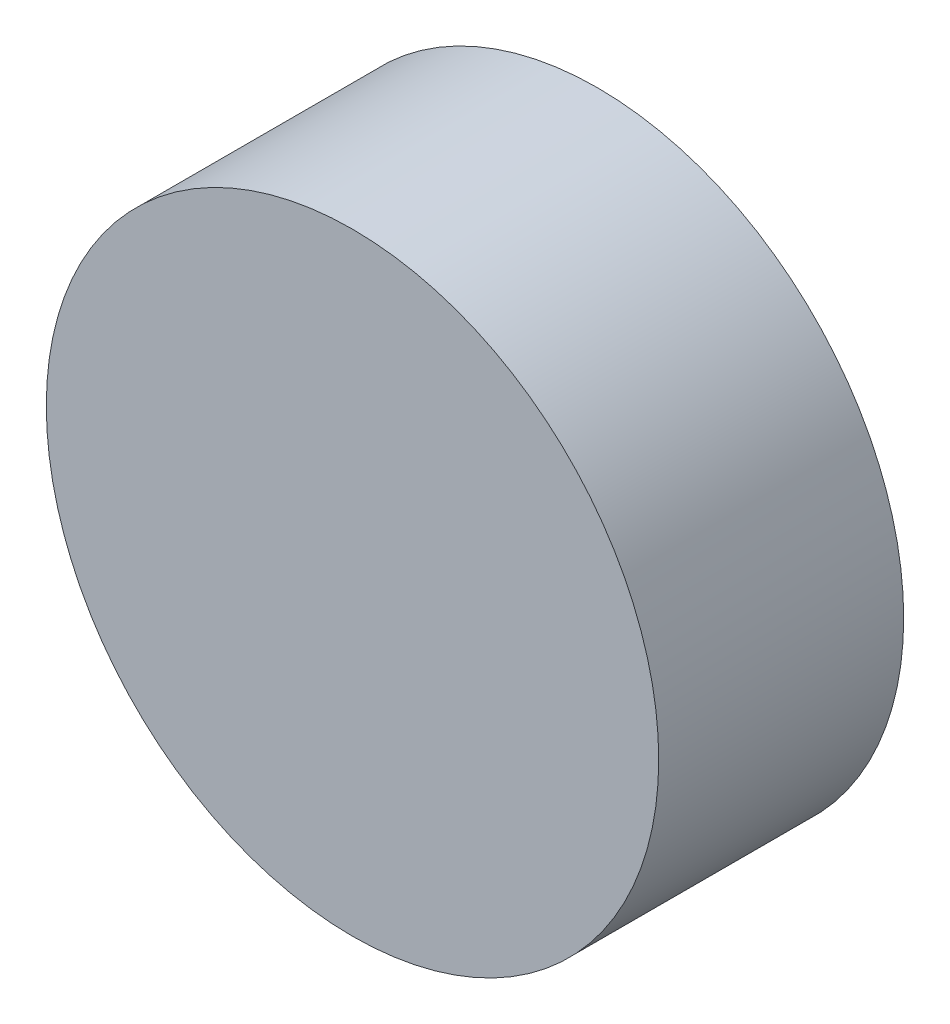
ISO-10303-21;
HEADER;
FILE_DESCRIPTION(('STEP AP214'),'2;1');
FILE_NAME('part.step','',(''),(''),'','','');
FILE_SCHEMA(('AUTOMOTIVE_DESIGN { 1 0 10303 214 1 1 1 1 }'));
ENDSEC;
DATA;
#1=APPLICATION_CONTEXT('core data for automotive mechanical design processes');
#2=APPLICATION_PROTOCOL_DEFINITION('international standard','automotive_design',2000,#1);
#3=PRODUCT_CONTEXT('',#1,'mechanical');
#4=PRODUCT('Part','Part','',(#3));
#5=PRODUCT_RELATED_PRODUCT_CATEGORY('part','',(#4));
#6=PRODUCT_DEFINITION_FORMATION('','',#4);
#7=PRODUCT_DEFINITION_CONTEXT('part definition',#1,'design');
#8=PRODUCT_DEFINITION('design','',#6,#7);
#9=PRODUCT_DEFINITION_SHAPE('','',#8);
#10=(LENGTH_UNIT() NAMED_UNIT(*) SI_UNIT(.MILLI.,.METRE.));
#11=(NAMED_UNIT(*) PLANE_ANGLE_UNIT() SI_UNIT($,.RADIAN.));
#12=(NAMED_UNIT(*) SI_UNIT($,.STERADIAN.) SOLID_ANGLE_UNIT());
#13=UNCERTAINTY_MEASURE_WITH_UNIT(LENGTH_MEASURE(1.E-05),#10,'distance_accuracy_value','');
#14=(GEOMETRIC_REPRESENTATION_CONTEXT(3) GLOBAL_UNCERTAINTY_ASSIGNED_CONTEXT((#13)) GLOBAL_UNIT_ASSIGNED_CONTEXT((#10,
#11,#12)) REPRESENTATION_CONTEXT('',''));
#15=CARTESIAN_POINT('',(0.,0.,0.));
#16=DIRECTION('',(0.,0.,1.));
#17=DIRECTION('',(1.,0.,0.));
#18=AXIS2_PLACEMENT_3D('',#15,#16,#17);
#19=CARTESIAN_POINT('',(0.,0.,200.));
#20=DIRECTION('',(0.,0.,-1.));
#21=DIRECTION('',(-1.,0.,0.));
#22=AXIS2_PLACEMENT_3D('',#19,#20,#21);
#23=CYLINDRICAL_SURFACE('',#22,250.);
#24=CARTESIAN_POINT('',(0.,0.,200.));
#25=DIRECTION('',(0.,0.,1.));
#26=DIRECTION('',(1.,0.,0.));
#27=AXIS2_PLACEMENT_3D('',#24,#25,#26);
#28=CIRCLE('',#27,250.);
#29=CARTESIAN_POINT('',(250.,0.,200.));
#30=VERTEX_POINT('',#29);
#31=EDGE_CURVE('E10',#30,#30,#28,.T.);
#32=ORIENTED_EDGE('',*,*,#31,.F.);
#33=EDGE_LOOP('',(#32));
#34=FACE_BOUND('',#33,.T.);
#35=CARTESIAN_POINT('',(0.,0.,0.));
#36=DIRECTION('',(0.,0.,1.));
#37=DIRECTION('',(1.,0.,0.));
#38=AXIS2_PLACEMENT_3D('',#35,#36,#37);
#39=CIRCLE('',#38,250.);
#40=CARTESIAN_POINT('',(250.,0.,0.));
#41=VERTEX_POINT('',#40);
#42=EDGE_CURVE('E34',#41,#41,#39,.T.);
#43=ORIENTED_EDGE('',*,*,#42,.T.);
#44=EDGE_LOOP('',(#43));
#45=FACE_BOUND('',#44,.T.);
#46=ADVANCED_FACE('F31',(#34,#45),#23,.T.);
#47=CARTESIAN_POINT('',(0.,0.,200.));
#48=DIRECTION('',(0.,0.,1.));
#49=DIRECTION('',(1.,0.,0.));
#50=AXIS2_PLACEMENT_3D('',#47,#48,#49);
#51=PLANE('',#50);
#52=ORIENTED_EDGE('',*,*,#31,.T.);
#53=EDGE_LOOP('',(#52));
#54=FACE_BOUND('',#53,.T.);
#55=ADVANCED_FACE('F46',(#54),#51,.T.);
#56=CARTESIAN_POINT('',(0.,0.,0.));
#57=DIRECTION('',(0.,0.,1.));
#58=DIRECTION('',(1.,0.,0.));
#59=AXIS2_PLACEMENT_3D('',#56,#57,#58);
#60=PLANE('',#59);
#61=ORIENTED_EDGE('',*,*,#42,.F.);
#62=EDGE_LOOP('',(#61));
#63=FACE_BOUND('',#62,.T.);
#64=ADVANCED_FACE('F44',(#63),#60,.F.);
#65=CLOSED_SHELL('',(#46,#55,#64));
#66=MANIFOLD_SOLID_BREP('B2',#65);
#67=ADVANCED_BREP_SHAPE_REPRESENTATION('',(#18,#66),#14);
#68=SHAPE_DEFINITION_REPRESENTATION(#9,#67);
ENDSEC;
END-ISO-10303-21;
